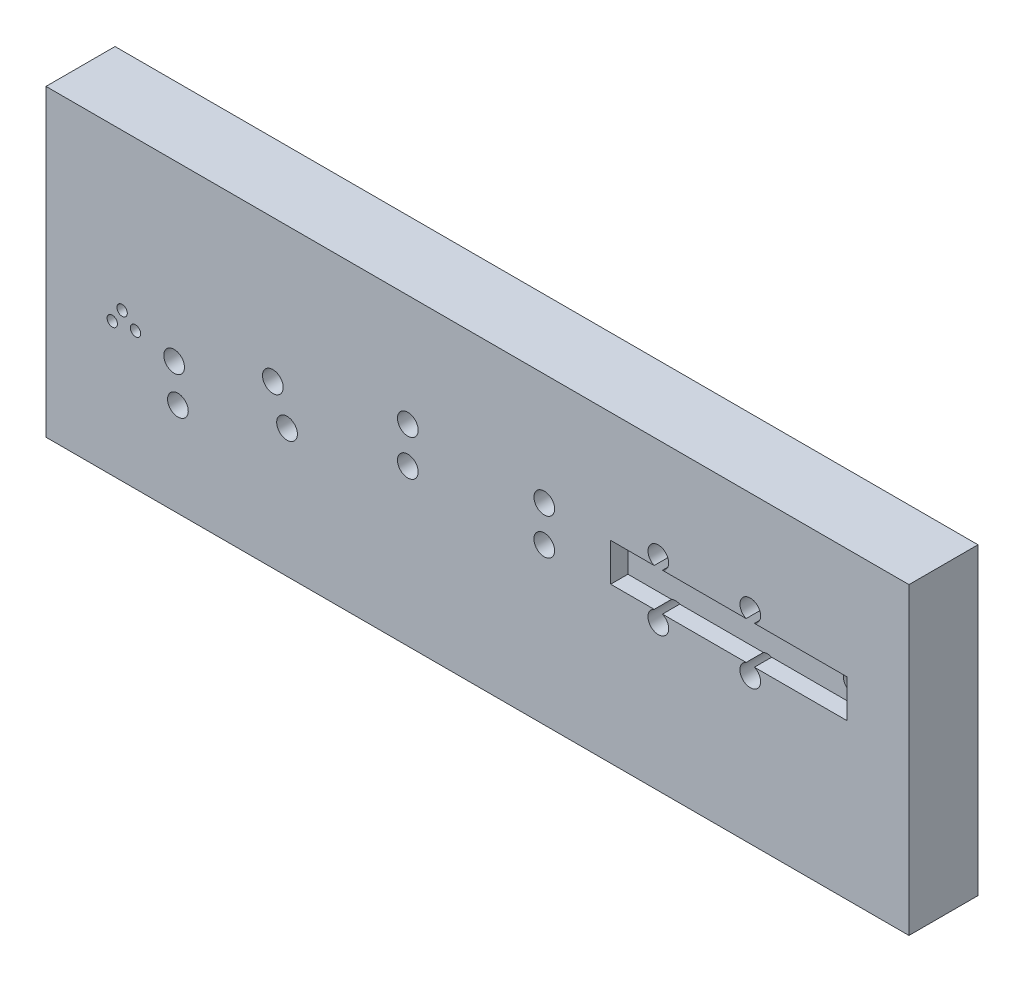
ISO-10303-21;
HEADER;
FILE_DESCRIPTION(('STEP AP214'),'2;1');
FILE_NAME('part.step','',(''),(''),'','','');
FILE_SCHEMA(('AUTOMOTIVE_DESIGN { 1 0 10303 214 1 1 1 1 }'));
ENDSEC;
DATA;
#1=APPLICATION_CONTEXT('core data for automotive mechanical design processes');
#2=APPLICATION_PROTOCOL_DEFINITION('international standard','automotive_design',2000,#1);
#3=PRODUCT_CONTEXT('',#1,'mechanical');
#4=PRODUCT('Part','Part','',(#3));
#5=PRODUCT_RELATED_PRODUCT_CATEGORY('part','',(#4));
#6=PRODUCT_DEFINITION_FORMATION('','',#4);
#7=PRODUCT_DEFINITION_CONTEXT('part definition',#1,'design');
#8=PRODUCT_DEFINITION('design','',#6,#7);
#9=PRODUCT_DEFINITION_SHAPE('','',#8);
#10=(LENGTH_UNIT() NAMED_UNIT(*) SI_UNIT(.MILLI.,.METRE.));
#11=(NAMED_UNIT(*) PLANE_ANGLE_UNIT() SI_UNIT($,.RADIAN.));
#12=(NAMED_UNIT(*) SI_UNIT($,.STERADIAN.) SOLID_ANGLE_UNIT());
#13=UNCERTAINTY_MEASURE_WITH_UNIT(LENGTH_MEASURE(1.E-05),#10,'distance_accuracy_value','');
#14=(GEOMETRIC_REPRESENTATION_CONTEXT(3) GLOBAL_UNCERTAINTY_ASSIGNED_CONTEXT((#13)) GLOBAL_UNIT_ASSIGNED_CONTEXT((#10,
#11,#12)) REPRESENTATION_CONTEXT('',''));
#15=CARTESIAN_POINT('',(0.,0.,0.));
#16=DIRECTION('',(0.,0.,1.));
#17=DIRECTION('',(1.,0.,0.));
#18=AXIS2_PLACEMENT_3D('',#15,#16,#17);
#19=CARTESIAN_POINT('',(-0.217324748737,6.294470708211,0.));
#20=DIRECTION('',(0.,0.,1.));
#21=DIRECTION('',(1.,0.,0.));
#22=AXIS2_PLACEMENT_3D('',#19,#20,#21);
#23=PLANE('',#22);
#24=DIRECTION('',(-1.,0.,0.));
#25=VECTOR('',#24,1.);
#26=CARTESIAN_POINT('',(-64.0771641872699,-2.10600230794942,0.));
#27=LINE('',#26,#25);
#28=CARTESIAN_POINT('',(-24.8364733566283,-2.10600230794942,0.));
#29=VERTEX_POINT('',#28);
#30=CARTESIAN_POINT('',(-49.0737084615593,-2.10600230794942,0.));
#31=VERTEX_POINT('',#30);
#32=EDGE_CURVE('E208',#29,#31,#27,.T.);
#33=ORIENTED_EDGE('',*,*,#32,.F.);
#34=CARTESIAN_POINT('',(-23.6375154758002,0.643997692050577,-7.21644966006352E-13));
#35=DIRECTION('',(0.,0.,1.));
#36=DIRECTION('',(1.,0.,0.));
#37=AXIS2_PLACEMENT_3D('',#34,#35,#36);
#38=CIRCLE('',#37,2.99999999999999);
#39=CARTESIAN_POINT('',(-22.438557594972,-2.10600230794942,0.));
#40=VERTEX_POINT('',#39);
#41=EDGE_CURVE('E322',#40,#29,#38,.T.);
#42=ORIENTED_EDGE('',*,*,#41,.F.);
#43=CARTESIAN_POINT('',(4.32283581273006,-2.10600230794942,0.));
#44=VERTEX_POINT('',#43);
#45=EDGE_CURVE('E186',#44,#40,#27,.T.);
#46=ORIENTED_EDGE('',*,*,#45,.F.);
#47=DIRECTION('',(0.,1.,0.));
#48=VECTOR('',#47,1.);
#49=CARTESIAN_POINT('',(4.32283581273006,-2.10600230794942,0.));
#50=LINE('',#49,#48);
#51=CARTESIAN_POINT('',(4.32283581273006,-13.1060023079494,0.));
#52=VERTEX_POINT('',#51);
#53=EDGE_CURVE('E203',#52,#44,#50,.T.);
#54=ORIENTED_EDGE('',*,*,#53,.F.);
#55=DIRECTION('',(1.,0.,0.));
#56=VECTOR('',#55,1.);
#57=CARTESIAN_POINT('',(-64.0771641872699,-13.1060023079494,0.));
#58=LINE('',#57,#56);
#59=CARTESIAN_POINT('',(-22.4385575949721,-13.1060023079494,0.));
#60=VERTEX_POINT('',#59);
#61=EDGE_CURVE('E200',#60,#52,#58,.T.);
#62=ORIENTED_EDGE('',*,*,#61,.F.);
#63=CARTESIAN_POINT('',(-23.6375154758002,-15.8560023079494,-2.91433543964104E-13));
#64=DIRECTION('',(0.,0.,1.));
#65=DIRECTION('',(1.,0.,0.));
#66=AXIS2_PLACEMENT_3D('',#63,#64,#65);
#67=CIRCLE('',#66,3.);
#68=CARTESIAN_POINT('',(-24.8364733566284,-13.1060023079494,0.));
#69=VERTEX_POINT('',#68);
#70=EDGE_CURVE('E316',#69,#60,#67,.T.);
#71=ORIENTED_EDGE('',*,*,#70,.F.);
#72=CARTESIAN_POINT('',(-49.0737084615593,-13.1060023079494,0.));
#73=VERTEX_POINT('',#72);
#74=EDGE_CURVE('E204',#73,#69,#58,.T.);
#75=ORIENTED_EDGE('',*,*,#74,.F.);
#76=CARTESIAN_POINT('',(-50.2726663423883,-15.8560023079494,-9.36750677027476E-13));
#77=DIRECTION('',(0.,0.,1.));
#78=DIRECTION('',(1.,0.,0.));
#79=AXIS2_PLACEMENT_3D('',#76,#77,#78);
#80=CIRCLE('',#79,3.00000000000036);
#81=CARTESIAN_POINT('',(-51.4716242232174,-13.1060023079494,0.));
#82=VERTEX_POINT('',#81);
#83=EDGE_CURVE('E304',#82,#73,#80,.T.);
#84=ORIENTED_EDGE('',*,*,#83,.F.);
#85=CARTESIAN_POINT('',(-64.0771641872699,-13.1060023079494,0.));
#86=VERTEX_POINT('',#85);
#87=EDGE_CURVE('E201',#86,#82,#58,.T.);
#88=ORIENTED_EDGE('',*,*,#87,.F.);
#89=DIRECTION('',(0.,-1.,0.));
#90=VECTOR('',#89,1.);
#91=CARTESIAN_POINT('',(-64.0771641872699,-2.10600230794942,0.));
#92=LINE('',#91,#90);
#93=CARTESIAN_POINT('',(-64.0771641872699,-2.10600230794942,0.));
#94=VERTEX_POINT('',#93);
#95=EDGE_CURVE('E180',#94,#86,#92,.T.);
#96=ORIENTED_EDGE('',*,*,#95,.F.);
#97=CARTESIAN_POINT('',(-51.4716242232174,-2.10600230794942,0.));
#98=VERTEX_POINT('',#97);
#99=EDGE_CURVE('E206',#98,#94,#27,.T.);
#100=ORIENTED_EDGE('',*,*,#99,.F.);
#101=CARTESIAN_POINT('',(-50.2726663423884,0.643997692050577,-9.12464548363801E-13));
#102=DIRECTION('',(0.,0.,1.));
#103=DIRECTION('',(1.,0.,0.));
#104=AXIS2_PLACEMENT_3D('',#101,#102,#103);
#105=CIRCLE('',#104,3.00000000000035);
#106=EDGE_CURVE('E303',#31,#98,#105,.T.);
#107=ORIENTED_EDGE('',*,*,#106,.F.);
#108=EDGE_LOOP('',(#33,#42,#46,#54,#62,#71,#75,#84,#88,#96,#100,#107));
#109=FACE_BOUND('',#108,.T.);
#110=CARTESIAN_POINT('',(-190.547902597559,-20.4199965908317,0.));
#111=DIRECTION('',(0.,0.,1.));
#112=DIRECTION('',(1.,0.,0.));
#113=AXIS2_PLACEMENT_3D('',#110,#111,#112);
#114=CIRCLE('',#113,2.99999999999999);
#115=CARTESIAN_POINT('',(-187.547902597559,-20.4199965908317,0.));
#116=VERTEX_POINT('',#115);
#117=EDGE_CURVE('E243',#116,#116,#114,.T.);
#118=ORIENTED_EDGE('',*,*,#117,.F.);
#119=EDGE_LOOP('',(#118));
#120=FACE_BOUND('',#119,.T.);
#121=CARTESIAN_POINT('',(-161.939318734172,-11.182544359814,-1.63757896132211E-12));
#122=DIRECTION('',(0.,0.,1.));
#123=DIRECTION('',(1.,0.,0.));
#124=AXIS2_PLACEMENT_3D('',#121,#122,#123);
#125=CIRCLE('',#124,2.99999999999997);
#126=CARTESIAN_POINT('',(-158.939318734172,-11.182544359814,-1.63757896132211E-12));
#127=VERTEX_POINT('',#126);
#128=EDGE_CURVE('E268',#127,#127,#125,.T.);
#129=ORIENTED_EDGE('',*,*,#128,.F.);
#130=EDGE_LOOP('',(#129));
#131=FACE_BOUND('',#130,.T.);
#132=CARTESIAN_POINT('',(-157.836641885035,-20.8478453210647,-1.71390679426509E-12));
#133=DIRECTION('',(0.,0.,1.));
#134=DIRECTION('',(1.,0.,0.));
#135=AXIS2_PLACEMENT_3D('',#132,#133,#134);
#136=CIRCLE('',#135,3.00000000000008);
#137=CARTESIAN_POINT('',(-154.836641885035,-20.8478453210647,-1.71390679426509E-12));
#138=VERTEX_POINT('',#137);
#139=EDGE_CURVE('E267',#138,#138,#136,.T.);
#140=ORIENTED_EDGE('',*,*,#139,.F.);
#141=EDGE_LOOP('',(#140));
#142=FACE_BOUND('',#141,.T.);
#143=CARTESIAN_POINT('',(-122.847163034911,-2.35600230794942,-1.26287869051112E-12));
#144=DIRECTION('',(0.,0.,1.));
#145=DIRECTION('',(1.,0.,0.));
#146=AXIS2_PLACEMENT_3D('',#143,#144,#145);
#147=CIRCLE('',#146,3.00000000000053);
#148=CARTESIAN_POINT('',(-119.847163034911,-2.35600230794942,-1.26287869051112E-12));
#149=VERTEX_POINT('',#148);
#150=EDGE_CURVE('E280',#149,#149,#147,.T.);
#151=ORIENTED_EDGE('',*,*,#150,.F.);
#152=EDGE_LOOP('',(#151));
#153=FACE_BOUND('',#152,.T.);
#154=CARTESIAN_POINT('',(-189.450353733249,-30.8624764921986,0.));
#155=DIRECTION('',(0.,0.,1.));
#156=DIRECTION('',(1.,0.,0.));
#157=AXIS2_PLACEMENT_3D('',#154,#155,#156);
#158=CIRCLE('',#157,2.99999999999999);
#159=CARTESIAN_POINT('',(-186.450353733249,-30.8624764921986,0.));
#160=VERTEX_POINT('',#159);
#161=EDGE_CURVE('E244',#160,#160,#158,.T.);
#162=ORIENTED_EDGE('',*,*,#161,.F.);
#163=EDGE_LOOP('',(#162));
#164=FACE_BOUND('',#163,.T.);
#165=CARTESIAN_POINT('',(-201.735803813802,-18.3451592008598,0.));
#166=DIRECTION('',(0.,0.,1.));
#167=DIRECTION('',(1.,0.,0.));
#168=AXIS2_PLACEMENT_3D('',#165,#166,#167);
#169=CIRCLE('',#168,1.50000000000002);
#170=CARTESIAN_POINT('',(-200.235803813802,-18.3451592008598,0.));
#171=VERTEX_POINT('',#170);
#172=EDGE_CURVE('E250',#171,#171,#169,.T.);
#173=ORIENTED_EDGE('',*,*,#172,.F.);
#174=EDGE_LOOP('',(#173));
#175=FACE_BOUND('',#174,.T.);
#176=CARTESIAN_POINT('',(-205.615830102835,-15.1673458385372,0.));
#177=DIRECTION('',(0.,0.,1.));
#178=DIRECTION('',(1.,0.,0.));
#179=AXIS2_PLACEMENT_3D('',#176,#177,#178);
#180=CIRCLE('',#179,1.5);
#181=CARTESIAN_POINT('',(-204.115830102835,-15.1673458385372,0.));
#182=VERTEX_POINT('',#181);
#183=EDGE_CURVE('E256',#182,#182,#180,.T.);
#184=ORIENTED_EDGE('',*,*,#183,.F.);
#185=EDGE_LOOP('',(#184));
#186=FACE_BOUND('',#185,.T.);
#187=CARTESIAN_POINT('',(-208.469626681245,-19.2915362873882,0.));
#188=DIRECTION('',(0.,0.,1.));
#189=DIRECTION('',(1.,0.,0.));
#190=AXIS2_PLACEMENT_3D('',#187,#188,#189);
#191=CIRCLE('',#190,1.5);
#192=CARTESIAN_POINT('',(-206.969626681245,-19.2915362873882,0.));
#193=VERTEX_POINT('',#192);
#194=EDGE_CURVE('E239',#193,#193,#191,.T.);
#195=ORIENTED_EDGE('',*,*,#194,.F.);
#196=EDGE_LOOP('',(#195));
#197=FACE_BOUND('',#196,.T.);
#198=CARTESIAN_POINT('',(-122.847163034911,-12.8560023079494,0.));
#199=DIRECTION('',(0.,0.,1.));
#200=DIRECTION('',(1.,0.,0.));
#201=AXIS2_PLACEMENT_3D('',#198,#199,#200);
#202=CIRCLE('',#201,3.00000000000092);
#203=CARTESIAN_POINT('',(-119.84716303491,-12.8560023079494,0.));
#204=VERTEX_POINT('',#203);
#205=EDGE_CURVE('E279',#204,#204,#202,.T.);
#206=ORIENTED_EDGE('',*,*,#205,.F.);
#207=EDGE_LOOP('',(#206));
#208=FACE_BOUND('',#207,.T.);
#209=CARTESIAN_POINT('',(-83.3180956729766,-12.8560023079494,0.));
#210=DIRECTION('',(0.,0.,1.));
#211=DIRECTION('',(1.,0.,0.));
#212=AXIS2_PLACEMENT_3D('',#209,#210,#211);
#213=CIRCLE('',#212,3.0000000000003);
#214=CARTESIAN_POINT('',(-80.3180956729763,-12.8560023079494,0.));
#215=VERTEX_POINT('',#214);
#216=EDGE_CURVE('E292',#215,#215,#213,.T.);
#217=ORIENTED_EDGE('',*,*,#216,.F.);
#218=EDGE_LOOP('',(#217));
#219=FACE_BOUND('',#218,.T.);
#220=CARTESIAN_POINT('',(-83.3180956729766,-2.35600230794942,-1.05124242644195E-12));
#221=DIRECTION('',(0.,0.,1.));
#222=DIRECTION('',(1.,0.,0.));
#223=AXIS2_PLACEMENT_3D('',#220,#221,#222);
#224=CIRCLE('',#223,3.00000000000014);
#225=CARTESIAN_POINT('',(-80.3180956729765,-2.35600230794942,-1.05124242644195E-12));
#226=VERTEX_POINT('',#225);
#227=EDGE_CURVE('E291',#226,#226,#224,.T.);
#228=ORIENTED_EDGE('',*,*,#227,.F.);
#229=EDGE_LOOP('',(#228));
#230=FACE_BOUND('',#229,.T.);
#231=DIRECTION('',(0.,-1.,0.));
#232=VECTOR('',#231,1.);
#233=CARTESIAN_POINT('',(-227.6645063345,0.,0.));
#234=LINE('',#233,#232);
#235=CARTESIAN_POINT('',(-227.6645063345,30.,0.));
#236=VERTEX_POINT('',#235);
#237=CARTESIAN_POINT('',(-227.6645063345,-58.0316112901866,0.));
#238=VERTEX_POINT('',#237);
#239=EDGE_CURVE('E157',#236,#238,#234,.T.);
#240=ORIENTED_EDGE('',*,*,#239,.T.);
#241=DIRECTION('',(-1.,0.,0.));
#242=VECTOR('',#241,1.);
#243=CARTESIAN_POINT('',(7.77850000000099,-58.0316112901866,0.));
#244=LINE('',#243,#242);
#245=CARTESIAN_POINT('',(22.3354936655,-58.0316112901866,0.));
#246=VERTEX_POINT('',#245);
#247=EDGE_CURVE('E152',#246,#238,#244,.T.);
#248=ORIENTED_EDGE('',*,*,#247,.F.);
#249=DIRECTION('',(0.,1.,0.));
#250=VECTOR('',#249,1.);
#251=CARTESIAN_POINT('',(22.3354936655,-58.0316112901866,0.));
#252=LINE('',#251,#250);
#253=CARTESIAN_POINT('',(22.3354936655,30.,0.));
#254=VERTEX_POINT('',#253);
#255=EDGE_CURVE('E155',#246,#254,#252,.T.);
#256=ORIENTED_EDGE('',*,*,#255,.T.);
#257=DIRECTION('',(-1.,0.,0.));
#258=VECTOR('',#257,1.);
#259=CARTESIAN_POINT('',(7.77850000000099,30.,0.));
#260=LINE('',#259,#258);
#261=EDGE_CURVE('E337',#254,#236,#260,.T.);
#262=ORIENTED_EDGE('',*,*,#261,.T.);
#263=EDGE_LOOP('',(#240,#248,#256,#262));
#264=FACE_BOUND('',#263,.T.);
#265=ADVANCED_FACE('F37',(#109,#120,#131,#142,#153,#164,#175,#186,#197,#208,#219,#230,#264),#23,.T.);
#266=CARTESIAN_POINT('',(-12.221499999999,0.,-20.));
#267=DIRECTION('',(0.,0.,1.));
#268=DIRECTION('',(0.,-1.,0.));
#269=AXIS2_PLACEMENT_3D('',#266,#267,#268);
#270=PLANE('',#269);
#271=DIRECTION('',(-1.,0.,0.));
#272=VECTOR('',#271,1.);
#273=CARTESIAN_POINT('',(7.77850000000099,30.,-20.));
#274=LINE('',#273,#272);
#275=CARTESIAN_POINT('',(22.3354936655,30.,-20.));
#276=VERTEX_POINT('',#275);
#277=CARTESIAN_POINT('',(-227.6645063345,30.,-20.));
#278=VERTEX_POINT('',#277);
#279=EDGE_CURVE('E338',#276,#278,#274,.T.);
#280=ORIENTED_EDGE('',*,*,#279,.F.);
#281=DIRECTION('',(0.,1.,0.));
#282=VECTOR('',#281,1.);
#283=CARTESIAN_POINT('',(22.3354936655,-58.0316112901866,-20.));
#284=LINE('',#283,#282);
#285=CARTESIAN_POINT('',(22.3354936655,-58.0316112901866,-20.));
#286=VERTEX_POINT('',#285);
#287=EDGE_CURVE('E172',#286,#276,#284,.T.);
#288=ORIENTED_EDGE('',*,*,#287,.F.);
#289=DIRECTION('',(-1.,0.,0.));
#290=VECTOR('',#289,1.);
#291=CARTESIAN_POINT('',(7.77850000000099,-58.0316112901866,-20.));
#292=LINE('',#291,#290);
#293=CARTESIAN_POINT('',(-227.6645063345,-58.0316112901866,-20.));
#294=VERTEX_POINT('',#293);
#295=EDGE_CURVE('E163',#286,#294,#292,.T.);
#296=ORIENTED_EDGE('',*,*,#295,.T.);
#297=DIRECTION('',(0.,-1.,0.));
#298=VECTOR('',#297,1.);
#299=CARTESIAN_POINT('',(-227.6645063345,0.,-20.));
#300=LINE('',#299,#298);
#301=EDGE_CURVE('E342',#278,#294,#300,.T.);
#302=ORIENTED_EDGE('',*,*,#301,.F.);
#303=EDGE_LOOP('',(#280,#288,#296,#302));
#304=FACE_BOUND('',#303,.T.);
#305=ADVANCED_FACE('F415',(#304),#270,.F.);
#306=CARTESIAN_POINT('',(-227.6645063345,0.,0.));
#307=DIRECTION('',(-1.,0.,0.));
#308=DIRECTION('',(0.,0.,1.));
#309=AXIS2_PLACEMENT_3D('',#306,#307,#308);
#310=PLANE('',#309);
#311=ORIENTED_EDGE('',*,*,#301,.T.);
#312=DIRECTION('',(0.,0.,1.));
#313=VECTOR('',#312,1.);
#314=CARTESIAN_POINT('',(-227.6645063345,-58.0316112901866,0.));
#315=LINE('',#314,#313);
#316=EDGE_CURVE('E332',#294,#238,#315,.T.);
#317=ORIENTED_EDGE('',*,*,#316,.T.);
#318=ORIENTED_EDGE('',*,*,#239,.F.);
#319=DIRECTION('',(0.,0.,-1.));
#320=VECTOR('',#319,1.);
#321=CARTESIAN_POINT('',(-227.6645063345,30.,0.));
#322=LINE('',#321,#320);
#323=EDGE_CURVE('E162',#236,#278,#322,.T.);
#324=ORIENTED_EDGE('',*,*,#323,.T.);
#325=EDGE_LOOP('',(#311,#317,#318,#324));
#326=FACE_BOUND('',#325,.T.);
#327=ADVANCED_FACE('F420',(#326),#310,.T.);
#328=CARTESIAN_POINT('',(7.77850000000099,30.,0.));
#329=DIRECTION('',(0.,1.,0.));
#330=DIRECTION('',(0.,0.,1.));
#331=AXIS2_PLACEMENT_3D('',#328,#329,#330);
#332=PLANE('',#331);
#333=ORIENTED_EDGE('',*,*,#323,.F.);
#334=ORIENTED_EDGE('',*,*,#261,.F.);
#335=DIRECTION('',(0.,0.,-1.));
#336=VECTOR('',#335,1.);
#337=CARTESIAN_POINT('',(22.3354936655,30.,0.));
#338=LINE('',#337,#336);
#339=EDGE_CURVE('E171',#254,#276,#338,.T.);
#340=ORIENTED_EDGE('',*,*,#339,.T.);
#341=ORIENTED_EDGE('',*,*,#279,.T.);
#342=EDGE_LOOP('',(#333,#334,#340,#341));
#343=FACE_BOUND('',#342,.T.);
#344=ADVANCED_FACE('F425',(#343),#332,.T.);
#345=CARTESIAN_POINT('',(7.77850000000099,-58.0316112901866,0.));
#346=DIRECTION('',(0.,-1.,0.));
#347=DIRECTION('',(0.,0.,-1.));
#348=AXIS2_PLACEMENT_3D('',#345,#346,#347);
#349=PLANE('',#348);
#350=ORIENTED_EDGE('',*,*,#316,.F.);
#351=ORIENTED_EDGE('',*,*,#295,.F.);
#352=DIRECTION('',(0.,0.,-1.));
#353=VECTOR('',#352,1.);
#354=CARTESIAN_POINT('',(22.3354936655,-58.0316112901866,0.));
#355=LINE('',#354,#353);
#356=EDGE_CURVE('E169',#246,#286,#355,.T.);
#357=ORIENTED_EDGE('',*,*,#356,.F.);
#358=ORIENTED_EDGE('',*,*,#247,.T.);
#359=EDGE_LOOP('',(#350,#351,#357,#358));
#360=FACE_BOUND('',#359,.T.);
#361=ADVANCED_FACE('F174',(#360),#349,.T.);
#362=CARTESIAN_POINT('',(-50.2726663423883,-15.8560023079494,-15.0000000000009));
#363=DIRECTION('',(0.,0.,1.));
#364=DIRECTION('',(1.,0.,0.));
#365=AXIS2_PLACEMENT_3D('',#362,#363,#364);
#366=CYLINDRICAL_SURFACE('',#365,3.00000000000036);
#367=ORIENTED_EDGE('',*,*,#83,.T.);
#368=DIRECTION('',(0.,0.,1.));
#369=VECTOR('',#368,1.);
#370=CARTESIAN_POINT('',(-49.0737084615593,-13.1060023079494,-15.0000000000009));
#371=LINE('',#370,#369);
#372=CARTESIAN_POINT('',(-49.0737084615593,-13.1060023079494,-5.));
#373=VERTEX_POINT('',#372);
#374=EDGE_CURVE('E230',#73,#373,#371,.F.);
#375=ORIENTED_EDGE('',*,*,#374,.T.);
#376=CARTESIAN_POINT('',(-50.2726663423883,-15.8560023079494,-5.));
#377=DIRECTION('',(0.,0.,1.));
#378=DIRECTION('',(1.,0.,0.));
#379=AXIS2_PLACEMENT_3D('',#376,#377,#378);
#380=CIRCLE('',#379,3.00000000000036);
#381=CARTESIAN_POINT('',(-51.4716242232174,-13.1060023079494,-5.));
#382=VERTEX_POINT('',#381);
#383=EDGE_CURVE('E223',#382,#373,#380,.F.);
#384=ORIENTED_EDGE('',*,*,#383,.F.);
#385=DIRECTION('',(0.,0.,1.));
#386=VECTOR('',#385,1.);
#387=CARTESIAN_POINT('',(-51.4716242232174,-13.1060023079494,-15.0000000000009));
#388=LINE('',#387,#386);
#389=EDGE_CURVE('E227',#382,#82,#388,.T.);
#390=ORIENTED_EDGE('',*,*,#389,.T.);
#391=EDGE_LOOP('',(#367,#375,#384,#390));
#392=FACE_BOUND('',#391,.T.);
#393=CARTESIAN_POINT('',(-50.2726663423883,-15.8560023079494,-15.0000000000009));
#394=DIRECTION('',(0.,0.,1.));
#395=DIRECTION('',(1.,0.,0.));
#396=AXIS2_PLACEMENT_3D('',#393,#394,#395);
#397=CIRCLE('',#396,3.00000000000036);
#398=CARTESIAN_POINT('',(-47.272666342388,-15.8560023079494,-15.0000000000009));
#399=VERTEX_POINT('',#398);
#400=EDGE_CURVE('E300',#399,#399,#397,.T.);
#401=ORIENTED_EDGE('',*,*,#400,.F.);
#402=EDGE_LOOP('',(#401));
#403=FACE_BOUND('',#402,.T.);
#404=ADVANCED_FACE('F384',(#392,#403),#366,.F.);
#405=CARTESIAN_POINT('',(0.,0.,-15.));
#406=DIRECTION('',(0.,0.,1.));
#407=DIRECTION('',(1.,0.,0.));
#408=AXIS2_PLACEMENT_3D('',#405,#406,#407);
#409=PLANE('',#408);
#410=ORIENTED_EDGE('',*,*,#400,.T.);
#411=EDGE_LOOP('',(#410));
#412=FACE_BOUND('',#411,.T.);
#413=ADVANCED_FACE('F434',(#412),#409,.T.);
#414=CARTESIAN_POINT('',(-83.3180956729766,-2.35600230794942,-15.000000000001));
#415=DIRECTION('',(0.,0.,1.));
#416=DIRECTION('',(1.,0.,0.));
#417=AXIS2_PLACEMENT_3D('',#414,#415,#416);
#418=CYLINDRICAL_SURFACE('',#417,3.00000000000014);
#419=CARTESIAN_POINT('',(-83.3180956729766,-2.35600230794942,-15.000000000001));
#420=DIRECTION('',(0.,0.,1.));
#421=DIRECTION('',(1.,0.,0.));
#422=AXIS2_PLACEMENT_3D('',#419,#420,#421);
#423=CIRCLE('',#422,3.00000000000014);
#424=CARTESIAN_POINT('',(-80.3180956729765,-2.35600230794942,-15.000000000001));
#425=VERTEX_POINT('',#424);
#426=EDGE_CURVE('E307',#425,#425,#423,.T.);
#427=ORIENTED_EDGE('',*,*,#426,.F.);
#428=EDGE_LOOP('',(#427));
#429=FACE_BOUND('',#428,.T.);
#430=ORIENTED_EDGE('',*,*,#227,.T.);
#431=EDGE_LOOP('',(#430));
#432=FACE_BOUND('',#431,.T.);
#433=ADVANCED_FACE('F439',(#429,#432),#418,.F.);
#434=CARTESIAN_POINT('',(0.,0.,-15.));
#435=DIRECTION('',(0.,0.,1.));
#436=DIRECTION('',(1.,0.,0.));
#437=AXIS2_PLACEMENT_3D('',#434,#435,#436);
#438=PLANE('',#437);
#439=ORIENTED_EDGE('',*,*,#426,.T.);
#440=EDGE_LOOP('',(#439));
#441=FACE_BOUND('',#440,.T.);
#442=ADVANCED_FACE('F444',(#441),#438,.T.);
#443=CARTESIAN_POINT('',(-83.3180956729766,-12.8560023079494,-15.));
#444=DIRECTION('',(0.,0.,1.));
#445=DIRECTION('',(1.,0.,0.));
#446=AXIS2_PLACEMENT_3D('',#443,#444,#445);
#447=CYLINDRICAL_SURFACE('',#446,3.0000000000003);
#448=CARTESIAN_POINT('',(-83.3180956729766,-12.8560023079494,-15.));
#449=DIRECTION('',(0.,0.,1.));
#450=DIRECTION('',(1.,0.,0.));
#451=AXIS2_PLACEMENT_3D('',#448,#449,#450);
#452=CIRCLE('',#451,3.0000000000003);
#453=CARTESIAN_POINT('',(-80.3180956729763,-12.8560023079494,-15.));
#454=VERTEX_POINT('',#453);
#455=EDGE_CURVE('E288',#454,#454,#452,.T.);
#456=ORIENTED_EDGE('',*,*,#455,.F.);
#457=EDGE_LOOP('',(#456));
#458=FACE_BOUND('',#457,.T.);
#459=ORIENTED_EDGE('',*,*,#216,.T.);
#460=EDGE_LOOP('',(#459));
#461=FACE_BOUND('',#460,.T.);
#462=ADVANCED_FACE('F447',(#458,#461),#447,.F.);
#463=CARTESIAN_POINT('',(0.,0.,-15.));
#464=DIRECTION('',(0.,0.,1.));
#465=DIRECTION('',(1.,0.,0.));
#466=AXIS2_PLACEMENT_3D('',#463,#464,#465);
#467=PLANE('',#466);
#468=ORIENTED_EDGE('',*,*,#455,.T.);
#469=EDGE_LOOP('',(#468));
#470=FACE_BOUND('',#469,.T.);
#471=ADVANCED_FACE('F569',(#470),#467,.T.);
#472=CARTESIAN_POINT('',(-122.847163034911,-12.8560023079494,-15.));
#473=DIRECTION('',(0.,0.,1.));
#474=DIRECTION('',(1.,0.,0.));
#475=AXIS2_PLACEMENT_3D('',#472,#473,#474);
#476=CYLINDRICAL_SURFACE('',#475,3.00000000000092);
#477=CARTESIAN_POINT('',(-122.847163034911,-12.8560023079494,-15.));
#478=DIRECTION('',(0.,0.,1.));
#479=DIRECTION('',(1.,0.,0.));
#480=AXIS2_PLACEMENT_3D('',#477,#478,#479);
#481=CIRCLE('',#480,3.00000000000092);
#482=CARTESIAN_POINT('',(-119.84716303491,-12.8560023079494,-15.));
#483=VERTEX_POINT('',#482);
#484=EDGE_CURVE('E295',#483,#483,#481,.T.);
#485=ORIENTED_EDGE('',*,*,#484,.F.);
#486=EDGE_LOOP('',(#485));
#487=FACE_BOUND('',#486,.T.);
#488=ORIENTED_EDGE('',*,*,#205,.T.);
#489=EDGE_LOOP('',(#488));
#490=FACE_BOUND('',#489,.T.);
#491=ADVANCED_FACE('F478',(#487,#490),#476,.F.);
#492=CARTESIAN_POINT('',(0.,0.,-15.));
#493=DIRECTION('',(0.,0.,1.));
#494=DIRECTION('',(1.,0.,0.));
#495=AXIS2_PLACEMENT_3D('',#492,#493,#494);
#496=PLANE('',#495);
#497=ORIENTED_EDGE('',*,*,#484,.T.);
#498=EDGE_LOOP('',(#497));
#499=FACE_BOUND('',#498,.T.);
#500=ADVANCED_FACE('F473',(#499),#496,.T.);
#501=CARTESIAN_POINT('',(-50.2726663423884,0.643997692050577,-15.0000000000009));
#502=DIRECTION('',(0.,0.,1.));
#503=DIRECTION('',(1.,0.,0.));
#504=AXIS2_PLACEMENT_3D('',#501,#502,#503);
#505=CYLINDRICAL_SURFACE('',#504,3.00000000000035);
#506=ORIENTED_EDGE('',*,*,#106,.T.);
#507=DIRECTION('',(0.,0.,1.));
#508=VECTOR('',#507,1.);
#509=CARTESIAN_POINT('',(-51.4716242232174,-2.10600230794942,-15.0000000000009));
#510=LINE('',#509,#508);
#511=CARTESIAN_POINT('',(-51.4716242232174,-2.10600230794942,-5.));
#512=VERTEX_POINT('',#511);
#513=EDGE_CURVE('E236',#98,#512,#510,.F.);
#514=ORIENTED_EDGE('',*,*,#513,.T.);
#515=CARTESIAN_POINT('',(-50.2726663423884,0.643997692050577,-5.));
#516=DIRECTION('',(0.,0.,1.));
#517=DIRECTION('',(1.,0.,0.));
#518=AXIS2_PLACEMENT_3D('',#515,#516,#517);
#519=CIRCLE('',#518,3.00000000000035);
#520=CARTESIAN_POINT('',(-49.0737084615593,-2.10600230794942,-5.));
#521=VERTEX_POINT('',#520);
#522=EDGE_CURVE('E221',#521,#512,#519,.F.);
#523=ORIENTED_EDGE('',*,*,#522,.F.);
#524=DIRECTION('',(0.,0.,1.));
#525=VECTOR('',#524,1.);
#526=CARTESIAN_POINT('',(-49.0737084615593,-2.10600230794942,-15.0000000000009));
#527=LINE('',#526,#525);
#528=EDGE_CURVE('E233',#521,#31,#527,.T.);
#529=ORIENTED_EDGE('',*,*,#528,.T.);
#530=EDGE_LOOP('',(#506,#514,#523,#529));
#531=FACE_BOUND('',#530,.T.);
#532=CARTESIAN_POINT('',(-50.2726663423884,0.643997692050577,-15.0000000000009));
#533=DIRECTION('',(0.,0.,1.));
#534=DIRECTION('',(1.,0.,0.));
#535=AXIS2_PLACEMENT_3D('',#532,#533,#534);
#536=CIRCLE('',#535,3.00000000000035);
#537=CARTESIAN_POINT('',(-47.272666342388,0.643997692050577,-15.0000000000009));
#538=VERTEX_POINT('',#537);
#539=EDGE_CURVE('E325',#538,#538,#536,.T.);
#540=ORIENTED_EDGE('',*,*,#539,.F.);
#541=EDGE_LOOP('',(#540));
#542=FACE_BOUND('',#541,.T.);
#543=ADVANCED_FACE('F470',(#531,#542),#505,.F.);
#544=CARTESIAN_POINT('',(0.,0.,-15.));
#545=DIRECTION('',(0.,0.,1.));
#546=DIRECTION('',(1.,0.,0.));
#547=AXIS2_PLACEMENT_3D('',#544,#545,#546);
#548=PLANE('',#547);
#549=ORIENTED_EDGE('',*,*,#539,.T.);
#550=EDGE_LOOP('',(#549));
#551=FACE_BOUND('',#550,.T.);
#552=ADVANCED_FACE('F467',(#551),#548,.T.);
#553=CARTESIAN_POINT('',(-23.6375154758002,0.643997692050577,-15.0000000000007));
#554=DIRECTION('',(0.,0.,1.));
#555=DIRECTION('',(1.,0.,0.));
#556=AXIS2_PLACEMENT_3D('',#553,#554,#555);
#557=CYLINDRICAL_SURFACE('',#556,2.99999999999999);
#558=ORIENTED_EDGE('',*,*,#41,.T.);
#559=DIRECTION('',(0.,0.,1.));
#560=VECTOR('',#559,1.);
#561=CARTESIAN_POINT('',(-24.8364733566283,-2.10600230794942,-15.0000000000007));
#562=LINE('',#561,#560);
#563=CARTESIAN_POINT('',(-24.8364733566283,-2.10600230794942,-5.));
#564=VERTEX_POINT('',#563);
#565=EDGE_CURVE('E11',#29,#564,#562,.F.);
#566=ORIENTED_EDGE('',*,*,#565,.T.);
#567=CARTESIAN_POINT('',(-23.6375154758002,0.643997692050577,-5.));
#568=DIRECTION('',(0.,0.,1.));
#569=DIRECTION('',(1.,0.,0.));
#570=AXIS2_PLACEMENT_3D('',#567,#568,#569);
#571=CIRCLE('',#570,2.99999999999999);
#572=CARTESIAN_POINT('',(-22.438557594972,-2.10600230794942,-5.));
#573=VERTEX_POINT('',#572);
#574=EDGE_CURVE('E212',#573,#564,#571,.F.);
#575=ORIENTED_EDGE('',*,*,#574,.F.);
#576=DIRECTION('',(0.,0.,1.));
#577=VECTOR('',#576,1.);
#578=CARTESIAN_POINT('',(-22.438557594972,-2.10600230794942,-15.0000000000007));
#579=LINE('',#578,#577);
#580=EDGE_CURVE('E44',#573,#40,#579,.T.);
#581=ORIENTED_EDGE('',*,*,#580,.T.);
#582=EDGE_LOOP('',(#558,#566,#575,#581));
#583=FACE_BOUND('',#582,.T.);
#584=CARTESIAN_POINT('',(-23.6375154758002,0.643997692050577,-15.0000000000007));
#585=DIRECTION('',(0.,0.,1.));
#586=DIRECTION('',(1.,0.,0.));
#587=AXIS2_PLACEMENT_3D('',#584,#585,#586);
#588=CIRCLE('',#587,2.99999999999999);
#589=CARTESIAN_POINT('',(-20.6375154758002,0.643997692050577,-15.0000000000007));
#590=VERTEX_POINT('',#589);
#591=EDGE_CURVE('E319',#590,#590,#588,.T.);
#592=ORIENTED_EDGE('',*,*,#591,.F.);
#593=EDGE_LOOP('',(#592));
#594=FACE_BOUND('',#593,.T.);
#595=ADVANCED_FACE('F356',(#583,#594),#557,.F.);
#596=CARTESIAN_POINT('',(0.,0.,-15.));
#597=DIRECTION('',(0.,0.,1.));
#598=DIRECTION('',(1.,0.,0.));
#599=AXIS2_PLACEMENT_3D('',#596,#597,#598);
#600=PLANE('',#599);
#601=ORIENTED_EDGE('',*,*,#591,.T.);
#602=EDGE_LOOP('',(#601));
#603=FACE_BOUND('',#602,.T.);
#604=ADVANCED_FACE('F460',(#603),#600,.T.);
#605=CARTESIAN_POINT('',(-23.6375154758002,-15.8560023079494,-15.0000000000003));
#606=DIRECTION('',(0.,0.,1.));
#607=DIRECTION('',(1.,0.,0.));
#608=AXIS2_PLACEMENT_3D('',#605,#606,#607);
#609=CYLINDRICAL_SURFACE('',#608,3.);
#610=ORIENTED_EDGE('',*,*,#70,.T.);
#611=DIRECTION('',(0.,0.,1.));
#612=VECTOR('',#611,1.);
#613=CARTESIAN_POINT('',(-22.4385575949721,-13.1060023079494,-15.0000000000003));
#614=LINE('',#613,#612);
#615=CARTESIAN_POINT('',(-22.4385575949721,-13.1060023079494,-5.));
#616=VERTEX_POINT('',#615);
#617=EDGE_CURVE('E350',#60,#616,#614,.F.);
#618=ORIENTED_EDGE('',*,*,#617,.T.);
#619=CARTESIAN_POINT('',(-23.6375154758002,-15.8560023079494,-5.));
#620=DIRECTION('',(0.,0.,1.));
#621=DIRECTION('',(1.,0.,0.));
#622=AXIS2_PLACEMENT_3D('',#619,#620,#621);
#623=CIRCLE('',#622,3.);
#624=CARTESIAN_POINT('',(-24.8364733566284,-13.1060023079494,-5.));
#625=VERTEX_POINT('',#624);
#626=EDGE_CURVE('E344',#625,#616,#623,.F.);
#627=ORIENTED_EDGE('',*,*,#626,.F.);
#628=DIRECTION('',(0.,0.,1.));
#629=VECTOR('',#628,1.);
#630=CARTESIAN_POINT('',(-24.8364733566284,-13.1060023079494,-15.0000000000003));
#631=LINE('',#630,#629);
#632=EDGE_CURVE('E347',#625,#69,#631,.T.);
#633=ORIENTED_EDGE('',*,*,#632,.T.);
#634=EDGE_LOOP('',(#610,#618,#627,#633));
#635=FACE_BOUND('',#634,.T.);
#636=CARTESIAN_POINT('',(-23.6375154758002,-15.8560023079494,-15.0000000000003));
#637=DIRECTION('',(0.,0.,1.));
#638=DIRECTION('',(1.,0.,0.));
#639=AXIS2_PLACEMENT_3D('',#636,#637,#638);
#640=CIRCLE('',#639,3.);
#641=CARTESIAN_POINT('',(-20.6375154758002,-15.8560023079494,-15.0000000000003));
#642=VERTEX_POINT('',#641);
#643=EDGE_CURVE('E312',#642,#642,#640,.T.);
#644=ORIENTED_EDGE('',*,*,#643,.F.);
#645=EDGE_LOOP('',(#644));
#646=FACE_BOUND('',#645,.T.);
#647=ADVANCED_FACE('F456',(#635,#646),#609,.F.);
#648=CARTESIAN_POINT('',(0.,0.,-15.));
#649=DIRECTION('',(0.,0.,1.));
#650=DIRECTION('',(1.,0.,0.));
#651=AXIS2_PLACEMENT_3D('',#648,#649,#650);
#652=PLANE('',#651);
#653=ORIENTED_EDGE('',*,*,#643,.T.);
#654=EDGE_LOOP('',(#653));
#655=FACE_BOUND('',#654,.T.);
#656=ADVANCED_FACE('F452',(#655),#652,.T.);
#657=CARTESIAN_POINT('',(-208.469626681245,-19.2915362873882,-15.));
#658=DIRECTION('',(0.,0.,1.));
#659=DIRECTION('',(1.,0.,0.));
#660=AXIS2_PLACEMENT_3D('',#657,#658,#659);
#661=CYLINDRICAL_SURFACE('',#660,1.5);
#662=CARTESIAN_POINT('',(-208.469626681245,-19.2915362873882,-15.));
#663=DIRECTION('',(0.,0.,1.));
#664=DIRECTION('',(1.,0.,0.));
#665=AXIS2_PLACEMENT_3D('',#662,#663,#664);
#666=CIRCLE('',#665,1.5);
#667=CARTESIAN_POINT('',(-206.969626681245,-19.2915362873882,-15.));
#668=VERTEX_POINT('',#667);
#669=EDGE_CURVE('E259',#668,#668,#666,.T.);
#670=ORIENTED_EDGE('',*,*,#669,.F.);
#671=EDGE_LOOP('',(#670));
#672=FACE_BOUND('',#671,.T.);
#673=ORIENTED_EDGE('',*,*,#194,.T.);
#674=EDGE_LOOP('',(#673));
#675=FACE_BOUND('',#674,.T.);
#676=ADVANCED_FACE('F455',(#672,#675),#661,.F.);
#677=CARTESIAN_POINT('',(0.,0.,-15.));
#678=DIRECTION('',(0.,0.,1.));
#679=DIRECTION('',(1.,0.,0.));
#680=AXIS2_PLACEMENT_3D('',#677,#678,#679);
#681=PLANE('',#680);
#682=ORIENTED_EDGE('',*,*,#669,.T.);
#683=EDGE_LOOP('',(#682));
#684=FACE_BOUND('',#683,.T.);
#685=ADVANCED_FACE('F535',(#684),#681,.T.);
#686=CARTESIAN_POINT('',(-205.615830102835,-15.1673458385372,-15.));
#687=DIRECTION('',(0.,0.,1.));
#688=DIRECTION('',(1.,0.,0.));
#689=AXIS2_PLACEMENT_3D('',#686,#687,#688);
#690=CYLINDRICAL_SURFACE('',#689,1.5);
#691=CARTESIAN_POINT('',(-205.615830102835,-15.1673458385372,-15.));
#692=DIRECTION('',(0.,0.,1.));
#693=DIRECTION('',(1.,0.,0.));
#694=AXIS2_PLACEMENT_3D('',#691,#692,#693);
#695=CIRCLE('',#694,1.5);
#696=CARTESIAN_POINT('',(-204.115830102835,-15.1673458385372,-15.));
#697=VERTEX_POINT('',#696);
#698=EDGE_CURVE('E253',#697,#697,#695,.T.);
#699=ORIENTED_EDGE('',*,*,#698,.F.);
#700=EDGE_LOOP('',(#699));
#701=FACE_BOUND('',#700,.T.);
#702=ORIENTED_EDGE('',*,*,#183,.T.);
#703=EDGE_LOOP('',(#702));
#704=FACE_BOUND('',#703,.T.);
#705=ADVANCED_FACE('F531',(#701,#704),#690,.F.);
#706=CARTESIAN_POINT('',(0.,0.,-15.));
#707=DIRECTION('',(0.,0.,1.));
#708=DIRECTION('',(1.,0.,0.));
#709=AXIS2_PLACEMENT_3D('',#706,#707,#708);
#710=PLANE('',#709);
#711=ORIENTED_EDGE('',*,*,#698,.T.);
#712=EDGE_LOOP('',(#711));
#713=FACE_BOUND('',#712,.T.);
#714=ADVANCED_FACE('F527',(#713),#710,.T.);
#715=CARTESIAN_POINT('',(-201.735803813802,-18.3451592008598,-15.));
#716=DIRECTION('',(0.,0.,1.));
#717=DIRECTION('',(1.,0.,0.));
#718=AXIS2_PLACEMENT_3D('',#715,#716,#717);
#719=CYLINDRICAL_SURFACE('',#718,1.50000000000002);
#720=CARTESIAN_POINT('',(-201.735803813802,-18.3451592008598,-15.));
#721=DIRECTION('',(0.,0.,1.));
#722=DIRECTION('',(1.,0.,0.));
#723=AXIS2_PLACEMENT_3D('',#720,#721,#722);
#724=CIRCLE('',#723,1.50000000000002);
#725=CARTESIAN_POINT('',(-200.235803813802,-18.3451592008598,-15.));
#726=VERTEX_POINT('',#725);
#727=EDGE_CURVE('E247',#726,#726,#724,.T.);
#728=ORIENTED_EDGE('',*,*,#727,.F.);
#729=EDGE_LOOP('',(#728));
#730=FACE_BOUND('',#729,.T.);
#731=ORIENTED_EDGE('',*,*,#172,.T.);
#732=EDGE_LOOP('',(#731));
#733=FACE_BOUND('',#732,.T.);
#734=ADVANCED_FACE('F523',(#730,#733),#719,.F.);
#735=CARTESIAN_POINT('',(0.,0.,-15.));
#736=DIRECTION('',(0.,0.,1.));
#737=DIRECTION('',(1.,0.,0.));
#738=AXIS2_PLACEMENT_3D('',#735,#736,#737);
#739=PLANE('',#738);
#740=ORIENTED_EDGE('',*,*,#727,.T.);
#741=EDGE_LOOP('',(#740));
#742=FACE_BOUND('',#741,.T.);
#743=ADVANCED_FACE('F519',(#742),#739,.T.);
#744=CARTESIAN_POINT('',(-189.450353733249,-30.8624764921986,-15.));
#745=DIRECTION('',(0.,0.,1.));
#746=DIRECTION('',(1.,0.,0.));
#747=AXIS2_PLACEMENT_3D('',#744,#745,#746);
#748=CYLINDRICAL_SURFACE('',#747,2.99999999999999);
#749=CARTESIAN_POINT('',(-189.450353733249,-30.8624764921986,-15.));
#750=DIRECTION('',(0.,0.,1.));
#751=DIRECTION('',(1.,0.,0.));
#752=AXIS2_PLACEMENT_3D('',#749,#750,#751);
#753=CIRCLE('',#752,2.99999999999999);
#754=CARTESIAN_POINT('',(-186.450353733249,-30.8624764921986,-15.));
#755=VERTEX_POINT('',#754);
#756=EDGE_CURVE('E240',#755,#755,#753,.T.);
#757=ORIENTED_EDGE('',*,*,#756,.F.);
#758=EDGE_LOOP('',(#757));
#759=FACE_BOUND('',#758,.T.);
#760=ORIENTED_EDGE('',*,*,#161,.T.);
#761=EDGE_LOOP('',(#760));
#762=FACE_BOUND('',#761,.T.);
#763=ADVANCED_FACE('F515',(#759,#762),#748,.F.);
#764=CARTESIAN_POINT('',(0.,0.,-15.));
#765=DIRECTION('',(0.,0.,1.));
#766=DIRECTION('',(1.,0.,0.));
#767=AXIS2_PLACEMENT_3D('',#764,#765,#766);
#768=PLANE('',#767);
#769=ORIENTED_EDGE('',*,*,#756,.T.);
#770=EDGE_LOOP('',(#769));
#771=FACE_BOUND('',#770,.T.);
#772=ADVANCED_FACE('F511',(#771),#768,.T.);
#773=CARTESIAN_POINT('',(-122.847163034911,-2.35600230794942,-15.0000000000013));
#774=DIRECTION('',(0.,0.,1.));
#775=DIRECTION('',(1.,0.,0.));
#776=AXIS2_PLACEMENT_3D('',#773,#774,#775);
#777=CYLINDRICAL_SURFACE('',#776,3.00000000000053);
#778=CARTESIAN_POINT('',(-122.847163034911,-2.35600230794942,-15.0000000000013));
#779=DIRECTION('',(0.,0.,1.));
#780=DIRECTION('',(1.,0.,0.));
#781=AXIS2_PLACEMENT_3D('',#778,#779,#780);
#782=CIRCLE('',#781,3.00000000000053);
#783=CARTESIAN_POINT('',(-119.847163034911,-2.35600230794942,-15.0000000000013));
#784=VERTEX_POINT('',#783);
#785=EDGE_CURVE('E276',#784,#784,#782,.T.);
#786=ORIENTED_EDGE('',*,*,#785,.F.);
#787=EDGE_LOOP('',(#786));
#788=FACE_BOUND('',#787,.T.);
#789=ORIENTED_EDGE('',*,*,#150,.T.);
#790=EDGE_LOOP('',(#789));
#791=FACE_BOUND('',#790,.T.);
#792=ADVANCED_FACE('F514',(#788,#791),#777,.F.);
#793=CARTESIAN_POINT('',(0.,0.,-15.));
#794=DIRECTION('',(0.,0.,1.));
#795=DIRECTION('',(1.,0.,0.));
#796=AXIS2_PLACEMENT_3D('',#793,#794,#795);
#797=PLANE('',#796);
#798=ORIENTED_EDGE('',*,*,#785,.T.);
#799=EDGE_LOOP('',(#798));
#800=FACE_BOUND('',#799,.T.);
#801=ADVANCED_FACE('F555',(#800),#797,.T.);
#802=CARTESIAN_POINT('',(-157.836641885035,-20.8478453210647,-15.0000000000017));
#803=DIRECTION('',(0.,0.,1.));
#804=DIRECTION('',(1.,0.,0.));
#805=AXIS2_PLACEMENT_3D('',#802,#803,#804);
#806=CYLINDRICAL_SURFACE('',#805,3.00000000000008);
#807=CARTESIAN_POINT('',(-157.836641885035,-20.8478453210647,-15.0000000000017));
#808=DIRECTION('',(0.,0.,1.));
#809=DIRECTION('',(1.,0.,0.));
#810=AXIS2_PLACEMENT_3D('',#807,#808,#809);
#811=CIRCLE('',#810,3.00000000000008);
#812=CARTESIAN_POINT('',(-154.836641885035,-20.8478453210647,-15.0000000000017));
#813=VERTEX_POINT('',#812);
#814=EDGE_CURVE('E283',#813,#813,#811,.T.);
#815=ORIENTED_EDGE('',*,*,#814,.F.);
#816=EDGE_LOOP('',(#815));
#817=FACE_BOUND('',#816,.T.);
#818=ORIENTED_EDGE('',*,*,#139,.T.);
#819=EDGE_LOOP('',(#818));
#820=FACE_BOUND('',#819,.T.);
#821=ADVANCED_FACE('F558',(#817,#820),#806,.F.);
#822=CARTESIAN_POINT('',(0.,0.,-15.));
#823=DIRECTION('',(0.,0.,1.));
#824=DIRECTION('',(1.,0.,0.));
#825=AXIS2_PLACEMENT_3D('',#822,#823,#824);
#826=PLANE('',#825);
#827=ORIENTED_EDGE('',*,*,#814,.T.);
#828=EDGE_LOOP('',(#827));
#829=FACE_BOUND('',#828,.T.);
#830=ADVANCED_FACE('F549',(#829),#826,.T.);
#831=CARTESIAN_POINT('',(-161.939318734172,-11.182544359814,-15.0000000000016));
#832=DIRECTION('',(0.,0.,1.));
#833=DIRECTION('',(1.,0.,0.));
#834=AXIS2_PLACEMENT_3D('',#831,#832,#833);
#835=CYLINDRICAL_SURFACE('',#834,2.99999999999997);
#836=CARTESIAN_POINT('',(-161.939318734172,-11.182544359814,-15.0000000000016));
#837=DIRECTION('',(0.,0.,1.));
#838=DIRECTION('',(1.,0.,0.));
#839=AXIS2_PLACEMENT_3D('',#836,#837,#838);
#840=CIRCLE('',#839,2.99999999999997);
#841=CARTESIAN_POINT('',(-158.939318734172,-11.182544359814,-15.0000000000016));
#842=VERTEX_POINT('',#841);
#843=EDGE_CURVE('E264',#842,#842,#840,.T.);
#844=ORIENTED_EDGE('',*,*,#843,.F.);
#845=EDGE_LOOP('',(#844));
#846=FACE_BOUND('',#845,.T.);
#847=ORIENTED_EDGE('',*,*,#128,.T.);
#848=EDGE_LOOP('',(#847));
#849=FACE_BOUND('',#848,.T.);
#850=ADVANCED_FACE('F546',(#846,#849),#835,.F.);
#851=CARTESIAN_POINT('',(0.,0.,-15.));
#852=DIRECTION('',(0.,0.,1.));
#853=DIRECTION('',(1.,0.,0.));
#854=AXIS2_PLACEMENT_3D('',#851,#852,#853);
#855=PLANE('',#854);
#856=ORIENTED_EDGE('',*,*,#843,.T.);
#857=EDGE_LOOP('',(#856));
#858=FACE_BOUND('',#857,.T.);
#859=ADVANCED_FACE('F543',(#858),#855,.T.);
#860=CARTESIAN_POINT('',(-190.547902597559,-20.4199965908317,-15.));
#861=DIRECTION('',(0.,0.,1.));
#862=DIRECTION('',(1.,0.,0.));
#863=AXIS2_PLACEMENT_3D('',#860,#861,#862);
#864=CYLINDRICAL_SURFACE('',#863,2.99999999999999);
#865=CARTESIAN_POINT('',(-190.547902597559,-20.4199965908317,-15.));
#866=DIRECTION('',(0.,0.,1.));
#867=DIRECTION('',(1.,0.,0.));
#868=AXIS2_PLACEMENT_3D('',#865,#866,#867);
#869=CIRCLE('',#868,2.99999999999999);
#870=CARTESIAN_POINT('',(-187.547902597559,-20.4199965908317,-15.));
#871=VERTEX_POINT('',#870);
#872=EDGE_CURVE('E271',#871,#871,#869,.T.);
#873=ORIENTED_EDGE('',*,*,#872,.F.);
#874=EDGE_LOOP('',(#873));
#875=FACE_BOUND('',#874,.T.);
#876=ORIENTED_EDGE('',*,*,#117,.T.);
#877=EDGE_LOOP('',(#876));
#878=FACE_BOUND('',#877,.T.);
#879=ADVANCED_FACE('F505',(#875,#878),#864,.F.);
#880=CARTESIAN_POINT('',(0.,0.,-15.));
#881=DIRECTION('',(0.,0.,1.));
#882=DIRECTION('',(1.,0.,0.));
#883=AXIS2_PLACEMENT_3D('',#880,#881,#882);
#884=PLANE('',#883);
#885=ORIENTED_EDGE('',*,*,#872,.T.);
#886=EDGE_LOOP('',(#885));
#887=FACE_BOUND('',#886,.T.);
#888=ADVANCED_FACE('F501',(#887),#884,.T.);
#889=CARTESIAN_POINT('',(4.32283581273006,-2.10600230794942,-5.));
#890=DIRECTION('',(1.,0.,0.));
#891=DIRECTION('',(0.,0.,-1.));
#892=AXIS2_PLACEMENT_3D('',#889,#890,#891);
#893=PLANE('',#892);
#894=ORIENTED_EDGE('',*,*,#53,.T.);
#895=DIRECTION('',(0.,0.,1.));
#896=VECTOR('',#895,1.);
#897=CARTESIAN_POINT('',(4.32283581273006,-2.10600230794942,-5.));
#898=LINE('',#897,#896);
#899=CARTESIAN_POINT('',(4.32283581273006,-2.10600230794942,-5.));
#900=VERTEX_POINT('',#899);
#901=EDGE_CURVE('E213',#900,#44,#898,.T.);
#902=ORIENTED_EDGE('',*,*,#901,.F.);
#903=DIRECTION('',(0.,1.,0.));
#904=VECTOR('',#903,1.);
#905=CARTESIAN_POINT('',(4.32283581273006,-2.10600230794942,-5.));
#906=LINE('',#905,#904);
#907=CARTESIAN_POINT('',(4.32283581273006,-7.60600230794928,-5.));
#908=VERTEX_POINT('',#907);
#909=EDGE_CURVE('E190',#908,#900,#906,.T.);
#910=ORIENTED_EDGE('',*,*,#909,.F.);
#911=CARTESIAN_POINT('',(4.32283581273006,-13.1060023079494,-5.));
#912=VERTEX_POINT('',#911);
#913=EDGE_CURVE('E51',#912,#908,#906,.T.);
#914=ORIENTED_EDGE('',*,*,#913,.F.);
#915=DIRECTION('',(0.,0.,1.));
#916=VECTOR('',#915,1.);
#917=CARTESIAN_POINT('',(4.32283581273006,-13.1060023079494,-5.));
#918=LINE('',#917,#916);
#919=EDGE_CURVE('E216',#912,#52,#918,.T.);
#920=ORIENTED_EDGE('',*,*,#919,.T.);
#921=EDGE_LOOP('',(#894,#902,#910,#914,#920));
#922=FACE_BOUND('',#921,.T.);
#923=ADVANCED_FACE('F396',(#922),#893,.F.);
#924=CARTESIAN_POINT('',(-64.0771641872699,-2.10600230794942,-5.));
#925=DIRECTION('',(0.,1.,0.));
#926=DIRECTION('',(0.,0.,1.));
#927=AXIS2_PLACEMENT_3D('',#924,#925,#926);
#928=PLANE('',#927);
#929=ORIENTED_EDGE('',*,*,#99,.T.);
#930=DIRECTION('',(0.,0.,1.));
#931=VECTOR('',#930,1.);
#932=CARTESIAN_POINT('',(-64.0771641872699,-2.10600230794942,-5.));
#933=LINE('',#932,#931);
#934=CARTESIAN_POINT('',(-64.0771641872699,-2.10600230794942,-5.));
#935=VERTEX_POINT('',#934);
#936=EDGE_CURVE('E209',#935,#94,#933,.T.);
#937=ORIENTED_EDGE('',*,*,#936,.F.);
#938=DIRECTION('',(-1.,0.,0.));
#939=VECTOR('',#938,1.);
#940=CARTESIAN_POINT('',(-64.0771641872699,-2.10600230794942,-5.));
#941=LINE('',#940,#939);
#942=EDGE_CURVE('E192',#512,#935,#941,.T.);
#943=ORIENTED_EDGE('',*,*,#942,.F.);
#944=ORIENTED_EDGE('',*,*,#513,.F.);
#945=EDGE_LOOP('',(#929,#937,#943,#944));
#946=FACE_BOUND('',#945,.T.);
#947=ADVANCED_FACE('F370',(#946),#928,.F.);
#948=EDGE_CURVE('E197',#564,#521,#941,.T.);
#949=ORIENTED_EDGE('',*,*,#948,.F.);
#950=ORIENTED_EDGE('',*,*,#565,.F.);
#951=ORIENTED_EDGE('',*,*,#32,.T.);
#952=ORIENTED_EDGE('',*,*,#528,.F.);
#953=EDGE_LOOP('',(#949,#950,#951,#952));
#954=FACE_BOUND('',#953,.T.);
#955=ADVANCED_FACE('F486',(#954),#928,.F.);
#956=EDGE_CURVE('E193',#900,#573,#941,.T.);
#957=ORIENTED_EDGE('',*,*,#956,.F.);
#958=ORIENTED_EDGE('',*,*,#901,.T.);
#959=ORIENTED_EDGE('',*,*,#45,.T.);
#960=ORIENTED_EDGE('',*,*,#580,.F.);
#961=EDGE_LOOP('',(#957,#958,#959,#960));
#962=FACE_BOUND('',#961,.T.);
#963=ADVANCED_FACE('F487',(#962),#928,.F.);
#964=CARTESIAN_POINT('',(-64.0771641872699,-13.1060023079494,-5.));
#965=DIRECTION('',(0.,-1.,0.));
#966=DIRECTION('',(0.,0.,-1.));
#967=AXIS2_PLACEMENT_3D('',#964,#965,#966);
#968=PLANE('',#967);
#969=ORIENTED_EDGE('',*,*,#74,.T.);
#970=ORIENTED_EDGE('',*,*,#632,.F.);
#971=DIRECTION('',(1.,0.,0.));
#972=VECTOR('',#971,1.);
#973=CARTESIAN_POINT('',(-64.0771641872699,-13.1060023079494,-5.));
#974=LINE('',#973,#972);
#975=EDGE_CURVE('E58',#373,#625,#974,.T.);
#976=ORIENTED_EDGE('',*,*,#975,.F.);
#977=ORIENTED_EDGE('',*,*,#374,.F.);
#978=EDGE_LOOP('',(#969,#970,#976,#977));
#979=FACE_BOUND('',#978,.T.);
#980=ADVANCED_FACE('F388',(#979),#968,.F.);
#981=CARTESIAN_POINT('',(-64.0771641872699,-13.1060023079494,-5.));
#982=VERTEX_POINT('',#981);
#983=EDGE_CURVE('E187',#982,#382,#974,.T.);
#984=ORIENTED_EDGE('',*,*,#983,.F.);
#985=DIRECTION('',(0.,0.,1.));
#986=VECTOR('',#985,1.);
#987=CARTESIAN_POINT('',(-64.0771641872699,-13.1060023079494,-5.));
#988=LINE('',#987,#986);
#989=EDGE_CURVE('E196',#982,#86,#988,.T.);
#990=ORIENTED_EDGE('',*,*,#989,.T.);
#991=ORIENTED_EDGE('',*,*,#87,.T.);
#992=ORIENTED_EDGE('',*,*,#389,.F.);
#993=EDGE_LOOP('',(#984,#990,#991,#992));
#994=FACE_BOUND('',#993,.T.);
#995=ADVANCED_FACE('F381',(#994),#968,.F.);
#996=ORIENTED_EDGE('',*,*,#61,.T.);
#997=ORIENTED_EDGE('',*,*,#919,.F.);
#998=EDGE_CURVE('E185',#616,#912,#974,.T.);
#999=ORIENTED_EDGE('',*,*,#998,.F.);
#1000=ORIENTED_EDGE('',*,*,#617,.F.);
#1001=EDGE_LOOP('',(#996,#997,#999,#1000));
#1002=FACE_BOUND('',#1001,.T.);
#1003=ADVANCED_FACE('F393',(#1002),#968,.F.);
#1004=CARTESIAN_POINT('',(0.,0.,-5.));
#1005=DIRECTION('',(0.,0.,1.));
#1006=DIRECTION('',(1.,0.,0.));
#1007=AXIS2_PLACEMENT_3D('',#1004,#1005,#1006);
#1008=PLANE('',#1007);
#1009=ORIENTED_EDGE('',*,*,#909,.T.);
#1010=ORIENTED_EDGE('',*,*,#956,.T.);
#1011=ORIENTED_EDGE('',*,*,#574,.T.);
#1012=ORIENTED_EDGE('',*,*,#948,.T.);
#1013=ORIENTED_EDGE('',*,*,#522,.T.);
#1014=ORIENTED_EDGE('',*,*,#942,.T.);
#1015=DIRECTION('',(0.,-1.,0.));
#1016=VECTOR('',#1015,1.);
#1017=CARTESIAN_POINT('',(-64.0771641872699,-2.10600230794942,-5.));
#1018=LINE('',#1017,#1016);
#1019=EDGE_CURVE('E182',#935,#982,#1018,.T.);
#1020=ORIENTED_EDGE('',*,*,#1019,.T.);
#1021=ORIENTED_EDGE('',*,*,#983,.T.);
#1022=ORIENTED_EDGE('',*,*,#383,.T.);
#1023=ORIENTED_EDGE('',*,*,#975,.T.);
#1024=ORIENTED_EDGE('',*,*,#626,.T.);
#1025=ORIENTED_EDGE('',*,*,#998,.T.);
#1026=ORIENTED_EDGE('',*,*,#913,.T.);
#1027=CARTESIAN_POINT('',(1.32283581273007,-7.60600230794928,-5.));
#1028=DIRECTION('',(0.,0.,1.));
#1029=DIRECTION('',(1.,0.,0.));
#1030=AXIS2_PLACEMENT_3D('',#1027,#1028,#1029);
#1031=CIRCLE('',#1030,2.99999999999999);
#1032=EDGE_CURVE('E225',#908,#908,#1031,.F.);
#1033=ORIENTED_EDGE('',*,*,#1032,.T.);
#1034=EDGE_LOOP('',(#1009,#1010,#1011,#1012,#1013,#1014,#1020,#1021,#1022,#1023,#1024,#1025,
#1026,#1033));
#1035=FACE_BOUND('',#1034,.T.);
#1036=ADVANCED_FACE('F386',(#1035),#1008,.T.);
#1037=CARTESIAN_POINT('',(-64.0771641872699,-2.10600230794942,-5.));
#1038=DIRECTION('',(-1.,0.,0.));
#1039=DIRECTION('',(0.,0.,1.));
#1040=AXIS2_PLACEMENT_3D('',#1037,#1038,#1039);
#1041=PLANE('',#1040);
#1042=ORIENTED_EDGE('',*,*,#95,.T.);
#1043=ORIENTED_EDGE('',*,*,#989,.F.);
#1044=ORIENTED_EDGE('',*,*,#1019,.F.);
#1045=ORIENTED_EDGE('',*,*,#936,.T.);
#1046=EDGE_LOOP('',(#1042,#1043,#1044,#1045));
#1047=FACE_BOUND('',#1046,.T.);
#1048=ADVANCED_FACE('F375',(#1047),#1041,.F.);
#1049=CARTESIAN_POINT('',(0.,0.,-15.));
#1050=DIRECTION('',(0.,0.,1.));
#1051=DIRECTION('',(1.,0.,0.));
#1052=AXIS2_PLACEMENT_3D('',#1049,#1050,#1051);
#1053=PLANE('',#1052);
#1054=CARTESIAN_POINT('',(1.32283581273007,-7.60600230794928,-15.));
#1055=DIRECTION('',(0.,0.,1.));
#1056=DIRECTION('',(1.,0.,0.));
#1057=AXIS2_PLACEMENT_3D('',#1054,#1055,#1056);
#1058=CIRCLE('',#1057,2.99999999999999);
#1059=CARTESIAN_POINT('',(4.32283581273007,-7.60600230794928,-15.));
#1060=VERTEX_POINT('',#1059);
#1061=EDGE_CURVE('E315',#1060,#1060,#1058,.T.);
#1062=ORIENTED_EDGE('',*,*,#1061,.T.);
#1063=EDGE_LOOP('',(#1062));
#1064=FACE_BOUND('',#1063,.T.);
#1065=ADVANCED_FACE('F402',(#1064),#1053,.T.);
#1066=CARTESIAN_POINT('',(1.32283581273007,-7.60600230794928,-15.));
#1067=DIRECTION('',(0.,0.,1.));
#1068=DIRECTION('',(1.,0.,0.));
#1069=AXIS2_PLACEMENT_3D('',#1066,#1067,#1068);
#1070=CYLINDRICAL_SURFACE('',#1069,2.99999999999999);
#1071=ORIENTED_EDGE('',*,*,#1061,.F.);
#1072=EDGE_LOOP('',(#1071));
#1073=FACE_BOUND('',#1072,.T.);
#1074=ORIENTED_EDGE('',*,*,#1032,.F.);
#1075=EDGE_LOOP('',(#1074));
#1076=FACE_BOUND('',#1075,.T.);
#1077=ADVANCED_FACE('F400',(#1073,#1076),#1070,.F.);
#1078=CARTESIAN_POINT('',(22.3354936655,-58.0316112901866,0.));
#1079=DIRECTION('',(1.,0.,0.));
#1080=DIRECTION('',(0.,0.,-1.));
#1081=AXIS2_PLACEMENT_3D('',#1078,#1079,#1080);
#1082=PLANE('',#1081);
#1083=ORIENTED_EDGE('',*,*,#339,.F.);
#1084=ORIENTED_EDGE('',*,*,#255,.F.);
#1085=ORIENTED_EDGE('',*,*,#356,.T.);
#1086=ORIENTED_EDGE('',*,*,#287,.T.);
#1087=EDGE_LOOP('',(#1083,#1084,#1085,#1086));
#1088=FACE_BOUND('',#1087,.T.);
#1089=ADVANCED_FACE('F167',(#1088),#1082,.T.);
#1090=CLOSED_SHELL('',(#265,#305,#327,#344,#361,#404,#413,#433,#442,#462,#471,#491,#500,#543,
#552,#595,#604,#647,#656,#676,#685,#705,#714,#734,#743,#763,#772,#792,#801,#821,#830,#850,#859,
#879,#888,#923,#947,#955,#963,#980,#995,#1003,#1036,#1048,#1065,#1077,#1089));
#1091=MANIFOLD_SOLID_BREP('B2',#1090);
#1092=ADVANCED_BREP_SHAPE_REPRESENTATION('',(#18,#1091),#14);
#1093=SHAPE_DEFINITION_REPRESENTATION(#9,#1092);
ENDSEC;
END-ISO-10303-21;
